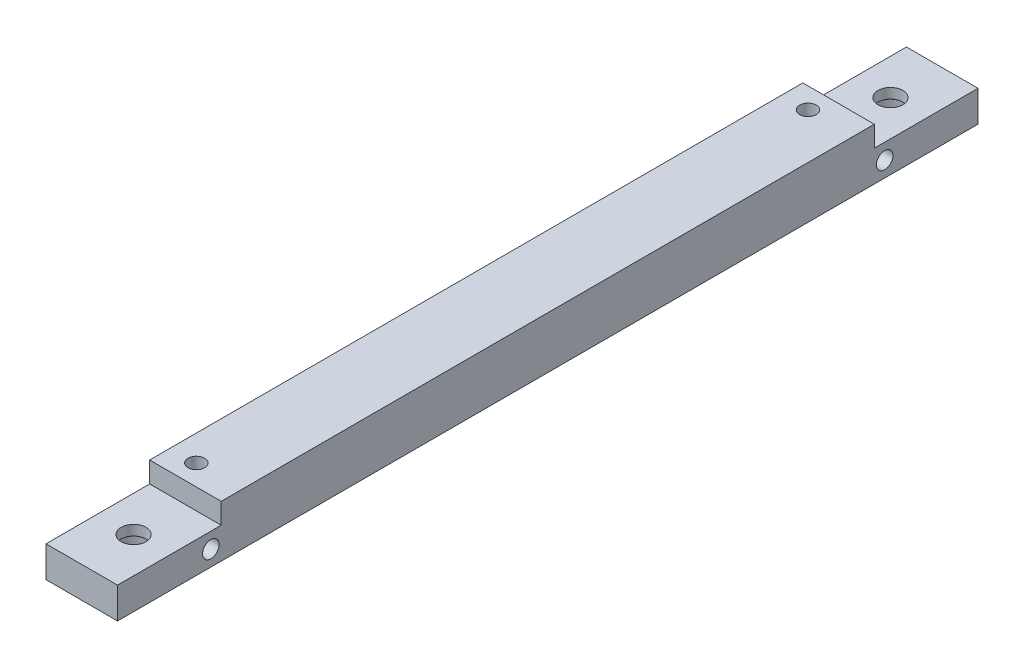
ISO-10303-21;
HEADER;
FILE_DESCRIPTION(('STEP AP214'),'2;1');
FILE_NAME('part.step','',(''),(''),'','','');
FILE_SCHEMA(('AUTOMOTIVE_DESIGN { 1 0 10303 214 1 1 1 1 }'));
ENDSEC;
DATA;
#1=APPLICATION_CONTEXT('core data for automotive mechanical design processes');
#2=APPLICATION_PROTOCOL_DEFINITION('international standard','automotive_design',2000,#1);
#3=PRODUCT_CONTEXT('',#1,'mechanical');
#4=PRODUCT('Part','Part','',(#3));
#5=PRODUCT_RELATED_PRODUCT_CATEGORY('part','',(#4));
#6=PRODUCT_DEFINITION_FORMATION('','',#4);
#7=PRODUCT_DEFINITION_CONTEXT('part definition',#1,'design');
#8=PRODUCT_DEFINITION('design','',#6,#7);
#9=PRODUCT_DEFINITION_SHAPE('','',#8);
#10=(LENGTH_UNIT() NAMED_UNIT(*) SI_UNIT(.MILLI.,.METRE.));
#11=(NAMED_UNIT(*) PLANE_ANGLE_UNIT() SI_UNIT($,.RADIAN.));
#12=(NAMED_UNIT(*) SI_UNIT($,.STERADIAN.) SOLID_ANGLE_UNIT());
#13=UNCERTAINTY_MEASURE_WITH_UNIT(LENGTH_MEASURE(1.E-05),#10,'distance_accuracy_value','');
#14=(GEOMETRIC_REPRESENTATION_CONTEXT(3) GLOBAL_UNCERTAINTY_ASSIGNED_CONTEXT((#13)) GLOBAL_UNIT_ASSIGNED_CONTEXT((#10,
#11,#12)) REPRESENTATION_CONTEXT('',''));
#15=CARTESIAN_POINT('',(0.,0.,0.));
#16=DIRECTION('',(0.,0.,1.));
#17=DIRECTION('',(1.,0.,0.));
#18=AXIS2_PLACEMENT_3D('',#15,#16,#17);
#19=CARTESIAN_POINT('',(8.5,-2.09841950804301,0.));
#20=DIRECTION('',(0.,0.,-1.));
#21=DIRECTION('',(0.,1.,0.));
#22=AXIS2_PLACEMENT_3D('',#19,#20,#21);
#23=PLANE('',#22);
#24=DIRECTION('',(1.,0.,0.));
#25=VECTOR('',#24,1.);
#26=CARTESIAN_POINT('',(0.,-5.09841950804301,0.));
#27=LINE('',#26,#25);
#28=CARTESIAN_POINT('',(1.6,-5.09841950804301,0.));
#29=VERTEX_POINT('',#28);
#30=CARTESIAN_POINT('',(8.5,-5.09841950804301,0.));
#31=VERTEX_POINT('',#30);
#32=EDGE_CURVE('E181',#29,#31,#27,.T.);
#33=ORIENTED_EDGE('',*,*,#32,.F.);
#34=DIRECTION('',(0.,-1.,0.));
#35=VECTOR('',#34,1.);
#36=CARTESIAN_POINT('',(1.6,1.90158049195699,0.));
#37=LINE('',#36,#35);
#38=CARTESIAN_POINT('',(1.6,-8.09841950804301,0.));
#39=VERTEX_POINT('',#38);
#40=EDGE_CURVE('E113',#29,#39,#37,.T.);
#41=ORIENTED_EDGE('',*,*,#40,.T.);
#42=DIRECTION('',(-1.,0.,0.));
#43=VECTOR('',#42,1.);
#44=CARTESIAN_POINT('',(8.5,-8.09841950804301,0.));
#45=LINE('',#44,#43);
#46=CARTESIAN_POINT('',(8.5,-8.09841950804301,0.));
#47=VERTEX_POINT('',#46);
#48=EDGE_CURVE('E46',#47,#39,#45,.T.);
#49=ORIENTED_EDGE('',*,*,#48,.F.);
#50=DIRECTION('',(0.,-1.,0.));
#51=VECTOR('',#50,1.);
#52=CARTESIAN_POINT('',(8.5,-2.09841950804301,0.));
#53=LINE('',#52,#51);
#54=EDGE_CURVE('E192',#31,#47,#53,.T.);
#55=ORIENTED_EDGE('',*,*,#54,.F.);
#56=EDGE_LOOP('',(#33,#41,#49,#55));
#57=FACE_BOUND('',#56,.T.);
#58=ADVANCED_FACE('F38',(#57),#23,.F.);
#59=CARTESIAN_POINT('',(8.5,-8.09841950804301,0.));
#60=DIRECTION('',(0.,1.,0.));
#61=DIRECTION('',(0.,0.,1.));
#62=AXIS2_PLACEMENT_3D('',#59,#60,#61);
#63=PLANE('',#62);
#64=CARTESIAN_POINT('',(4.1,-8.09841950804302,-71.));
#65=DIRECTION('',(0.,-1.,0.));
#66=DIRECTION('',(0.,0.,-1.));
#67=AXIS2_PLACEMENT_3D('',#64,#65,#66);
#68=CIRCLE('',#67,0.799999999999988);
#69=CARTESIAN_POINT('',(4.1,-8.09841950804302,-71.8));
#70=VERTEX_POINT('',#69);
#71=EDGE_CURVE('E443',#70,#70,#68,.T.);
#72=ORIENTED_EDGE('',*,*,#71,.F.);
#73=EDGE_LOOP('',(#72));
#74=FACE_BOUND('',#73,.T.);
#75=CARTESIAN_POINT('',(4.1,-8.09841950804302,-12.));
#76=DIRECTION('',(0.,-1.,0.));
#77=DIRECTION('',(0.,0.,-1.));
#78=AXIS2_PLACEMENT_3D('',#75,#76,#77);
#79=CIRCLE('',#78,0.799999999999988);
#80=CARTESIAN_POINT('',(4.1,-8.09841950804302,-12.8));
#81=VERTEX_POINT('',#80);
#82=EDGE_CURVE('E445',#81,#81,#79,.T.);
#83=ORIENTED_EDGE('',*,*,#82,.F.);
#84=EDGE_LOOP('',(#83));
#85=FACE_BOUND('',#84,.T.);
#86=CARTESIAN_POINT('',(5.05,-8.09841950804301,-5.));
#87=DIRECTION('',(0.,-1.,0.));
#88=DIRECTION('',(0.,0.,-1.));
#89=AXIS2_PLACEMENT_3D('',#86,#87,#88);
#90=CIRCLE('',#89,2.2);
#91=CARTESIAN_POINT('',(5.05,-8.09841950804301,-7.2));
#92=VERTEX_POINT('',#91);
#93=EDGE_CURVE('E453',#92,#92,#90,.T.);
#94=ORIENTED_EDGE('',*,*,#93,.F.);
#95=EDGE_LOOP('',(#94));
#96=FACE_BOUND('',#95,.T.);
#97=CARTESIAN_POINT('',(5.05,-8.09841950804301,-78.));
#98=DIRECTION('',(0.,-1.,0.));
#99=DIRECTION('',(0.,0.,-1.));
#100=AXIS2_PLACEMENT_3D('',#97,#98,#99);
#101=CIRCLE('',#100,2.2);
#102=CARTESIAN_POINT('',(5.05,-8.09841950804301,-80.2));
#103=VERTEX_POINT('',#102);
#104=EDGE_CURVE('E465',#103,#103,#101,.T.);
#105=ORIENTED_EDGE('',*,*,#104,.F.);
#106=EDGE_LOOP('',(#105));
#107=FACE_BOUND('',#106,.T.);
#108=ORIENTED_EDGE('',*,*,#48,.T.);
#109=DIRECTION('',(0.,0.,1.));
#110=VECTOR('',#109,1.);
#111=CARTESIAN_POINT('',(1.6,-8.09841950804301,-83.));
#112=LINE('',#111,#110);
#113=CARTESIAN_POINT('',(1.6,-8.09841950804301,-83.));
#114=VERTEX_POINT('',#113);
#115=EDGE_CURVE('E106',#114,#39,#112,.T.);
#116=ORIENTED_EDGE('',*,*,#115,.F.);
#117=DIRECTION('',(-1.,0.,0.));
#118=VECTOR('',#117,1.);
#119=CARTESIAN_POINT('',(8.5,-8.09841950804301,-83.));
#120=LINE('',#119,#118);
#121=CARTESIAN_POINT('',(8.5,-8.09841950804301,-83.));
#122=VERTEX_POINT('',#121);
#123=EDGE_CURVE('E120',#122,#114,#120,.T.);
#124=ORIENTED_EDGE('',*,*,#123,.F.);
#125=DIRECTION('',(0.,0.,-1.));
#126=VECTOR('',#125,1.);
#127=CARTESIAN_POINT('',(8.5,-8.09841950804301,0.));
#128=LINE('',#127,#126);
#129=EDGE_CURVE('E130',#47,#122,#128,.T.);
#130=ORIENTED_EDGE('',*,*,#129,.F.);
#131=EDGE_LOOP('',(#108,#116,#124,#130));
#132=FACE_BOUND('',#131,.T.);
#133=ADVANCED_FACE('F118',(#74,#85,#96,#107,#132),#63,.F.);
#134=CARTESIAN_POINT('',(8.5,-2.09841950804301,-83.));
#135=DIRECTION('',(0.,0.,1.));
#136=DIRECTION('',(1.,0.,0.));
#137=AXIS2_PLACEMENT_3D('',#134,#135,#136);
#138=PLANE('',#137);
#139=ORIENTED_EDGE('',*,*,#123,.T.);
#140=DIRECTION('',(0.,-1.,0.));
#141=VECTOR('',#140,1.);
#142=CARTESIAN_POINT('',(1.6,1.90158049195699,-83.));
#143=LINE('',#142,#141);
#144=CARTESIAN_POINT('',(1.6,-5.09841950804301,-83.));
#145=VERTEX_POINT('',#144);
#146=EDGE_CURVE('E102',#145,#114,#143,.T.);
#147=ORIENTED_EDGE('',*,*,#146,.F.);
#148=DIRECTION('',(1.,0.,0.));
#149=VECTOR('',#148,1.);
#150=CARTESIAN_POINT('',(-1.5,-5.09841950804301,-83.));
#151=LINE('',#150,#149);
#152=CARTESIAN_POINT('',(8.5,-5.09841950804301,-83.));
#153=VERTEX_POINT('',#152);
#154=EDGE_CURVE('E179',#145,#153,#151,.T.);
#155=ORIENTED_EDGE('',*,*,#154,.T.);
#156=DIRECTION('',(0.,1.,0.));
#157=VECTOR('',#156,1.);
#158=CARTESIAN_POINT('',(8.5,-2.09841950804301,-83.));
#159=LINE('',#158,#157);
#160=EDGE_CURVE('E127',#122,#153,#159,.T.);
#161=ORIENTED_EDGE('',*,*,#160,.F.);
#162=EDGE_LOOP('',(#139,#147,#155,#161));
#163=FACE_BOUND('',#162,.T.);
#164=ADVANCED_FACE('F125',(#163),#138,.F.);
#165=CARTESIAN_POINT('',(8.5,0.,0.));
#166=DIRECTION('',(1.,0.,0.));
#167=DIRECTION('',(0.,0.,-1.));
#168=AXIS2_PLACEMENT_3D('',#165,#166,#167);
#169=PLANE('',#168);
#170=CARTESIAN_POINT('',(8.5,-6.59841950804301,-74.));
#171=DIRECTION('',(-1.,0.,0.));
#172=DIRECTION('',(0.,0.,1.));
#173=AXIS2_PLACEMENT_3D('',#170,#171,#172);
#174=CIRCLE('',#173,0.799999999999998);
#175=CARTESIAN_POINT('',(8.5,-6.59841950804301,-73.2));
#176=VERTEX_POINT('',#175);
#177=EDGE_CURVE('E162',#176,#176,#174,.T.);
#178=ORIENTED_EDGE('',*,*,#177,.T.);
#179=EDGE_LOOP('',(#178));
#180=FACE_BOUND('',#179,.T.);
#181=CARTESIAN_POINT('',(8.5,-6.59841950804301,-9.));
#182=DIRECTION('',(-1.,0.,0.));
#183=DIRECTION('',(0.,0.,1.));
#184=AXIS2_PLACEMENT_3D('',#181,#182,#183);
#185=CIRCLE('',#184,0.799999999999998);
#186=CARTESIAN_POINT('',(8.5,-6.59841950804301,-8.2));
#187=VERTEX_POINT('',#186);
#188=EDGE_CURVE('E165',#187,#187,#185,.T.);
#189=ORIENTED_EDGE('',*,*,#188,.T.);
#190=EDGE_LOOP('',(#189));
#191=FACE_BOUND('',#190,.T.);
#192=DIRECTION('',(0.,0.,-1.));
#193=VECTOR('',#192,1.);
#194=CARTESIAN_POINT('',(8.5,-3.09841950804302,0.));
#195=LINE('',#194,#193);
#196=CARTESIAN_POINT('',(8.5,-3.09841950804302,-10.));
#197=VERTEX_POINT('',#196);
#198=CARTESIAN_POINT('',(8.5,-3.09841950804302,-73.));
#199=VERTEX_POINT('',#198);
#200=EDGE_CURVE('E171',#197,#199,#195,.T.);
#201=ORIENTED_EDGE('',*,*,#200,.F.);
#202=DIRECTION('',(0.,1.,0.));
#203=VECTOR('',#202,1.);
#204=CARTESIAN_POINT('',(8.5,-5.09841950804301,-10.));
#205=LINE('',#204,#203);
#206=CARTESIAN_POINT('',(8.5,-5.09841950804301,-10.));
#207=VERTEX_POINT('',#206);
#208=EDGE_CURVE('E189',#207,#197,#205,.T.);
#209=ORIENTED_EDGE('',*,*,#208,.F.);
#210=DIRECTION('',(0.,0.,-1.));
#211=VECTOR('',#210,1.);
#212=CARTESIAN_POINT('',(8.5,-5.09841950804301,-10.));
#213=LINE('',#212,#211);
#214=EDGE_CURVE('E184',#31,#207,#213,.T.);
#215=ORIENTED_EDGE('',*,*,#214,.F.);
#216=ORIENTED_EDGE('',*,*,#54,.T.);
#217=ORIENTED_EDGE('',*,*,#129,.T.);
#218=ORIENTED_EDGE('',*,*,#160,.T.);
#219=DIRECTION('',(0.,0.,-1.));
#220=VECTOR('',#219,1.);
#221=CARTESIAN_POINT('',(8.5,-5.09841950804301,-83.));
#222=LINE('',#221,#220);
#223=CARTESIAN_POINT('',(8.5,-5.09841950804301,-73.));
#224=VERTEX_POINT('',#223);
#225=EDGE_CURVE('E175',#224,#153,#222,.T.);
#226=ORIENTED_EDGE('',*,*,#225,.F.);
#227=DIRECTION('',(0.,-1.,0.));
#228=VECTOR('',#227,1.);
#229=CARTESIAN_POINT('',(8.5,-2.09841950804302,-73.));
#230=LINE('',#229,#228);
#231=EDGE_CURVE('E173',#199,#224,#230,.T.);
#232=ORIENTED_EDGE('',*,*,#231,.F.);
#233=EDGE_LOOP('',(#201,#209,#215,#216,#217,#218,#226,#232));
#234=FACE_BOUND('',#233,.T.);
#235=ADVANCED_FACE('F195',(#180,#191,#234),#169,.T.);
#236=CARTESIAN_POINT('',(0.,-5.09841950804301,-10.));
#237=DIRECTION('',(0.,0.,-1.));
#238=DIRECTION('',(-1.,0.,0.));
#239=AXIS2_PLACEMENT_3D('',#236,#237,#238);
#240=PLANE('',#239);
#241=DIRECTION('',(-1.,0.,0.));
#242=VECTOR('',#241,1.);
#243=CARTESIAN_POINT('',(10.,-3.09841950804302,-10.));
#244=LINE('',#243,#242);
#245=CARTESIAN_POINT('',(1.6,-3.09841950804302,-10.));
#246=VERTEX_POINT('',#245);
#247=EDGE_CURVE('E168',#197,#246,#244,.T.);
#248=ORIENTED_EDGE('',*,*,#247,.T.);
#249=DIRECTION('',(0.,-1.,0.));
#250=VECTOR('',#249,1.);
#251=CARTESIAN_POINT('',(1.6,-5.09841950804301,-10.));
#252=LINE('',#251,#250);
#253=CARTESIAN_POINT('',(1.6,-5.09841950804301,-10.));
#254=VERTEX_POINT('',#253);
#255=EDGE_CURVE('E54',#246,#254,#252,.T.);
#256=ORIENTED_EDGE('',*,*,#255,.T.);
#257=DIRECTION('',(-1.,0.,0.));
#258=VECTOR('',#257,1.);
#259=CARTESIAN_POINT('',(0.,-5.09841950804301,-10.));
#260=LINE('',#259,#258);
#261=EDGE_CURVE('E186',#207,#254,#260,.T.);
#262=ORIENTED_EDGE('',*,*,#261,.F.);
#263=ORIENTED_EDGE('',*,*,#208,.T.);
#264=EDGE_LOOP('',(#248,#256,#262,#263));
#265=FACE_BOUND('',#264,.T.);
#266=ADVANCED_FACE('F207',(#265),#240,.F.);
#267=CARTESIAN_POINT('',(0.,-5.09841950804301,0.));
#268=DIRECTION('',(0.,1.,0.));
#269=DIRECTION('',(0.,0.,1.));
#270=AXIS2_PLACEMENT_3D('',#267,#268,#269);
#271=PLANE('',#270);
#272=CARTESIAN_POINT('',(5.05,-5.09841950804301,-5.));
#273=DIRECTION('',(0.,1.,0.));
#274=DIRECTION('',(0.,0.,1.));
#275=AXIS2_PLACEMENT_3D('',#272,#273,#274);
#276=CIRCLE('',#275,1.2);
#277=CARTESIAN_POINT('',(5.05,-5.09841950804301,-3.8));
#278=VERTEX_POINT('',#277);
#279=EDGE_CURVE('E41',#278,#278,#276,.T.);
#280=ORIENTED_EDGE('',*,*,#279,.F.);
#281=EDGE_LOOP('',(#280));
#282=FACE_BOUND('',#281,.T.);
#283=DIRECTION('',(0.,0.,-1.));
#284=VECTOR('',#283,1.);
#285=CARTESIAN_POINT('',(1.6,-5.09841950804301,0.));
#286=LINE('',#285,#284);
#287=EDGE_CURVE('E160',#29,#254,#286,.T.);
#288=ORIENTED_EDGE('',*,*,#287,.F.);
#289=ORIENTED_EDGE('',*,*,#32,.T.);
#290=ORIENTED_EDGE('',*,*,#214,.T.);
#291=ORIENTED_EDGE('',*,*,#261,.T.);
#292=EDGE_LOOP('',(#288,#289,#290,#291));
#293=FACE_BOUND('',#292,.T.);
#294=ADVANCED_FACE('F203',(#282,#293),#271,.T.);
#295=CARTESIAN_POINT('',(-1.5,-5.09841950804301,-83.));
#296=DIRECTION('',(0.,-1.,0.));
#297=DIRECTION('',(0.,0.,-1.));
#298=AXIS2_PLACEMENT_3D('',#295,#296,#297);
#299=PLANE('',#298);
#300=CARTESIAN_POINT('',(5.05,-5.09841950804301,-78.));
#301=DIRECTION('',(0.,-1.,0.));
#302=DIRECTION('',(0.,0.,-1.));
#303=AXIS2_PLACEMENT_3D('',#300,#301,#302);
#304=CIRCLE('',#303,1.2);
#305=CARTESIAN_POINT('',(5.05,-5.09841950804301,-79.2));
#306=VERTEX_POINT('',#305);
#307=EDGE_CURVE('E123',#306,#306,#304,.T.);
#308=ORIENTED_EDGE('',*,*,#307,.T.);
#309=EDGE_LOOP('',(#308));
#310=FACE_BOUND('',#309,.T.);
#311=ORIENTED_EDGE('',*,*,#154,.F.);
#312=DIRECTION('',(0.,0.,1.));
#313=VECTOR('',#312,1.);
#314=CARTESIAN_POINT('',(1.6,-5.09841950804301,-83.));
#315=LINE('',#314,#313);
#316=CARTESIAN_POINT('',(1.6,-5.09841950804301,-73.));
#317=VERTEX_POINT('',#316);
#318=EDGE_CURVE('E109',#145,#317,#315,.T.);
#319=ORIENTED_EDGE('',*,*,#318,.T.);
#320=DIRECTION('',(1.,0.,0.));
#321=VECTOR('',#320,1.);
#322=CARTESIAN_POINT('',(-1.5,-5.09841950804301,-73.));
#323=LINE('',#322,#321);
#324=EDGE_CURVE('E178',#317,#224,#323,.T.);
#325=ORIENTED_EDGE('',*,*,#324,.T.);
#326=ORIENTED_EDGE('',*,*,#225,.T.);
#327=EDGE_LOOP('',(#311,#319,#325,#326));
#328=FACE_BOUND('',#327,.T.);
#329=ADVANCED_FACE('F214',(#310,#328),#299,.F.);
#330=CARTESIAN_POINT('',(-1.5,-2.09841950804302,-73.));
#331=DIRECTION('',(0.,0.,1.));
#332=DIRECTION('',(1.,0.,0.));
#333=AXIS2_PLACEMENT_3D('',#330,#331,#332);
#334=PLANE('',#333);
#335=ORIENTED_EDGE('',*,*,#324,.F.);
#336=DIRECTION('',(0.,1.,0.));
#337=VECTOR('',#336,1.);
#338=CARTESIAN_POINT('',(1.6,-2.09841950804302,-73.));
#339=LINE('',#338,#337);
#340=CARTESIAN_POINT('',(1.6,-3.09841950804302,-73.));
#341=VERTEX_POINT('',#340);
#342=EDGE_CURVE('E156',#317,#341,#339,.T.);
#343=ORIENTED_EDGE('',*,*,#342,.T.);
#344=DIRECTION('',(1.,0.,0.));
#345=VECTOR('',#344,1.);
#346=CARTESIAN_POINT('',(-1.5,-3.09841950804302,-73.));
#347=LINE('',#346,#345);
#348=EDGE_CURVE('E11',#341,#199,#347,.T.);
#349=ORIENTED_EDGE('',*,*,#348,.T.);
#350=ORIENTED_EDGE('',*,*,#231,.T.);
#351=EDGE_LOOP('',(#335,#343,#349,#350));
#352=FACE_BOUND('',#351,.T.);
#353=ADVANCED_FACE('F212',(#352),#334,.F.);
#354=CARTESIAN_POINT('',(10.,-3.09841950804302,-73.));
#355=DIRECTION('',(0.,-1.,0.));
#356=DIRECTION('',(0.,0.,-1.));
#357=AXIS2_PLACEMENT_3D('',#354,#355,#356);
#358=PLANE('',#357);
#359=CARTESIAN_POINT('',(4.1,-3.09841950804302,-71.));
#360=DIRECTION('',(0.,-1.,0.));
#361=DIRECTION('',(0.,0.,-1.));
#362=AXIS2_PLACEMENT_3D('',#359,#360,#361);
#363=CIRCLE('',#362,0.799999999999999);
#364=CARTESIAN_POINT('',(4.1,-3.09841950804302,-71.8));
#365=VERTEX_POINT('',#364);
#366=EDGE_CURVE('E441',#365,#365,#363,.T.);
#367=ORIENTED_EDGE('',*,*,#366,.T.);
#368=EDGE_LOOP('',(#367));
#369=FACE_BOUND('',#368,.T.);
#370=CARTESIAN_POINT('',(4.1,-3.09841950804302,-12.));
#371=DIRECTION('',(0.,-1.,0.));
#372=DIRECTION('',(0.,0.,-1.));
#373=AXIS2_PLACEMENT_3D('',#370,#371,#372);
#374=CIRCLE('',#373,0.799999999999999);
#375=CARTESIAN_POINT('',(4.1,-3.09841950804302,-12.8));
#376=VERTEX_POINT('',#375);
#377=EDGE_CURVE('E450',#376,#376,#374,.T.);
#378=ORIENTED_EDGE('',*,*,#377,.T.);
#379=EDGE_LOOP('',(#378));
#380=FACE_BOUND('',#379,.T.);
#381=ORIENTED_EDGE('',*,*,#348,.F.);
#382=DIRECTION('',(0.,0.,1.));
#383=VECTOR('',#382,1.);
#384=CARTESIAN_POINT('',(1.6,-3.09841950804302,-73.));
#385=LINE('',#384,#383);
#386=EDGE_CURVE('E154',#341,#246,#385,.T.);
#387=ORIENTED_EDGE('',*,*,#386,.T.);
#388=ORIENTED_EDGE('',*,*,#247,.F.);
#389=ORIENTED_EDGE('',*,*,#200,.T.);
#390=EDGE_LOOP('',(#381,#387,#388,#389));
#391=FACE_BOUND('',#390,.T.);
#392=ADVANCED_FACE('F210',(#369,#380,#391),#358,.F.);
#393=CARTESIAN_POINT('',(0.,-6.59841950804301,-9.));
#394=DIRECTION('',(-1.,0.,0.));
#395=DIRECTION('',(0.,0.,1.));
#396=AXIS2_PLACEMENT_3D('',#393,#394,#395);
#397=CYLINDRICAL_SURFACE('',#396,0.799999999999998);
#398=CARTESIAN_POINT('',(1.6,-6.59841950804301,-9.));
#399=DIRECTION('',(1.,0.,0.));
#400=DIRECTION('',(0.,0.,-1.));
#401=AXIS2_PLACEMENT_3D('',#398,#399,#400);
#402=CIRCLE('',#401,0.799999999999998);
#403=CARTESIAN_POINT('',(1.6,-6.59841950804301,-9.8));
#404=VERTEX_POINT('',#403);
#405=EDGE_CURVE('E136',#404,#404,#402,.F.);
#406=ORIENTED_EDGE('',*,*,#405,.T.);
#407=EDGE_LOOP('',(#406));
#408=FACE_BOUND('',#407,.T.);
#409=ORIENTED_EDGE('',*,*,#188,.F.);
#410=EDGE_LOOP('',(#409));
#411=FACE_BOUND('',#410,.T.);
#412=ADVANCED_FACE('F361',(#408,#411),#397,.F.);
#413=CARTESIAN_POINT('',(0.,-6.59841950804301,-74.));
#414=DIRECTION('',(-1.,0.,0.));
#415=DIRECTION('',(0.,0.,1.));
#416=AXIS2_PLACEMENT_3D('',#413,#414,#415);
#417=CYLINDRICAL_SURFACE('',#416,0.799999999999998);
#418=CARTESIAN_POINT('',(1.6,-6.59841950804301,-74.));
#419=DIRECTION('',(1.,0.,0.));
#420=DIRECTION('',(0.,0.,-1.));
#421=AXIS2_PLACEMENT_3D('',#418,#419,#420);
#422=CIRCLE('',#421,0.799999999999998);
#423=CARTESIAN_POINT('',(1.6,-6.59841950804301,-74.8));
#424=VERTEX_POINT('',#423);
#425=EDGE_CURVE('E134',#424,#424,#422,.F.);
#426=ORIENTED_EDGE('',*,*,#425,.T.);
#427=EDGE_LOOP('',(#426));
#428=FACE_BOUND('',#427,.T.);
#429=ORIENTED_EDGE('',*,*,#177,.F.);
#430=EDGE_LOOP('',(#429));
#431=FACE_BOUND('',#430,.T.);
#432=ADVANCED_FACE('F392',(#428,#431),#417,.F.);
#433=CARTESIAN_POINT('',(1.6,1.90158049195699,-83.));
#434=DIRECTION('',(1.,0.,0.));
#435=DIRECTION('',(0.,0.,-1.));
#436=AXIS2_PLACEMENT_3D('',#433,#434,#435);
#437=PLANE('',#436);
#438=ORIENTED_EDGE('',*,*,#287,.T.);
#439=ORIENTED_EDGE('',*,*,#255,.F.);
#440=ORIENTED_EDGE('',*,*,#386,.F.);
#441=ORIENTED_EDGE('',*,*,#342,.F.);
#442=ORIENTED_EDGE('',*,*,#318,.F.);
#443=ORIENTED_EDGE('',*,*,#146,.T.);
#444=ORIENTED_EDGE('',*,*,#115,.T.);
#445=ORIENTED_EDGE('',*,*,#40,.F.);
#446=EDGE_LOOP('',(#438,#439,#440,#441,#442,#443,#444,#445));
#447=FACE_BOUND('',#446,.T.);
#448=ORIENTED_EDGE('',*,*,#425,.F.);
#449=EDGE_LOOP('',(#448));
#450=FACE_BOUND('',#449,.T.);
#451=ORIENTED_EDGE('',*,*,#405,.F.);
#452=EDGE_LOOP('',(#451));
#453=FACE_BOUND('',#452,.T.);
#454=ADVANCED_FACE('F104',(#447,#450,#453),#437,.F.);
#455=CARTESIAN_POINT('',(5.05,-8.09841950804301,-78.));
#456=DIRECTION('',(0.,-1.,0.));
#457=DIRECTION('',(0.,0.,-1.));
#458=AXIS2_PLACEMENT_3D('',#455,#456,#457);
#459=CYLINDRICAL_SURFACE('',#458,1.2);
#460=CARTESIAN_POINT('',(5.05,-6.07341950804301,-78.));
#461=DIRECTION('',(0.,-1.,0.));
#462=DIRECTION('',(0.,0.,-1.));
#463=AXIS2_PLACEMENT_3D('',#460,#461,#462);
#464=CIRCLE('',#463,1.2);
#465=CARTESIAN_POINT('',(5.05,-6.07341950804301,-79.2));
#466=VERTEX_POINT('',#465);
#467=EDGE_CURVE('E138',#466,#466,#464,.T.);
#468=ORIENTED_EDGE('',*,*,#467,.T.);
#469=EDGE_LOOP('',(#468));
#470=FACE_BOUND('',#469,.T.);
#471=ORIENTED_EDGE('',*,*,#307,.F.);
#472=EDGE_LOOP('',(#471));
#473=FACE_BOUND('',#472,.T.);
#474=ADVANCED_FACE('F266',(#470,#473),#459,.F.);
#475=CARTESIAN_POINT('',(5.05,-6.09841950804301,-78.));
#476=DIRECTION('',(0.,-1.,0.));
#477=DIRECTION('',(0.,0.,-1.));
#478=AXIS2_PLACEMENT_3D('',#475,#476,#477);
#479=CONICAL_SURFACE('',#478,1.225,0.785398163397466);
#480=ORIENTED_EDGE('',*,*,#467,.F.);
#481=EDGE_LOOP('',(#480));
#482=FACE_BOUND('',#481,.T.);
#483=CARTESIAN_POINT('',(5.05,-6.09841950804301,-78.));
#484=DIRECTION('',(0.,-1.,0.));
#485=DIRECTION('',(0.,0.,-1.));
#486=AXIS2_PLACEMENT_3D('',#483,#484,#485);
#487=CIRCLE('',#486,1.225);
#488=CARTESIAN_POINT('',(5.05,-6.09841950804301,-79.225));
#489=VERTEX_POINT('',#488);
#490=EDGE_CURVE('E142',#489,#489,#487,.T.);
#491=ORIENTED_EDGE('',*,*,#490,.T.);
#492=EDGE_LOOP('',(#491));
#493=FACE_BOUND('',#492,.T.);
#494=ADVANCED_FACE('F271',(#482,#493),#479,.F.);
#495=CARTESIAN_POINT('',(6.275,-6.09841950804301,-78.));
#496=DIRECTION('',(0.,1.,0.));
#497=DIRECTION('',(0.,0.,1.));
#498=AXIS2_PLACEMENT_3D('',#495,#496,#497);
#499=PLANE('',#498);
#500=ORIENTED_EDGE('',*,*,#490,.F.);
#501=EDGE_LOOP('',(#500));
#502=FACE_BOUND('',#501,.T.);
#503=CARTESIAN_POINT('',(5.05,-6.09841950804301,-78.));
#504=DIRECTION('',(0.,-1.,0.));
#505=DIRECTION('',(0.,0.,-1.));
#506=AXIS2_PLACEMENT_3D('',#503,#504,#505);
#507=CIRCLE('',#506,2.2);
#508=CARTESIAN_POINT('',(5.05,-6.09841950804301,-80.2));
#509=VERTEX_POINT('',#508);
#510=EDGE_CURVE('E147',#509,#509,#507,.T.);
#511=ORIENTED_EDGE('',*,*,#510,.T.);
#512=EDGE_LOOP('',(#511));
#513=FACE_BOUND('',#512,.T.);
#514=ADVANCED_FACE('F281',(#502,#513),#499,.F.);
#515=CARTESIAN_POINT('',(5.05,-8.09841950804301,-78.));
#516=DIRECTION('',(0.,-1.,0.));
#517=DIRECTION('',(0.,0.,-1.));
#518=AXIS2_PLACEMENT_3D('',#515,#516,#517);
#519=CYLINDRICAL_SURFACE('',#518,2.2);
#520=ORIENTED_EDGE('',*,*,#510,.F.);
#521=EDGE_LOOP('',(#520));
#522=FACE_BOUND('',#521,.T.);
#523=ORIENTED_EDGE('',*,*,#104,.T.);
#524=EDGE_LOOP('',(#523));
#525=FACE_BOUND('',#524,.T.);
#526=ADVANCED_FACE('F291',(#522,#525),#519,.F.);
#527=CARTESIAN_POINT('',(5.05,-8.09841950804301,-5.));
#528=DIRECTION('',(0.,-1.,0.));
#529=DIRECTION('',(0.,0.,-1.));
#530=AXIS2_PLACEMENT_3D('',#527,#528,#529);
#531=CYLINDRICAL_SURFACE('',#530,1.2);
#532=ORIENTED_EDGE('',*,*,#279,.T.);
#533=EDGE_LOOP('',(#532));
#534=FACE_BOUND('',#533,.T.);
#535=CARTESIAN_POINT('',(5.05,-6.07341950804301,-5.));
#536=DIRECTION('',(0.,-1.,0.));
#537=DIRECTION('',(0.,0.,-1.));
#538=AXIS2_PLACEMENT_3D('',#535,#536,#537);
#539=CIRCLE('',#538,1.2);
#540=CARTESIAN_POINT('',(5.05,-6.07341950804301,-6.2));
#541=VERTEX_POINT('',#540);
#542=EDGE_CURVE('E462',#541,#541,#539,.T.);
#543=ORIENTED_EDGE('',*,*,#542,.T.);
#544=EDGE_LOOP('',(#543));
#545=FACE_BOUND('',#544,.T.);
#546=ADVANCED_FACE('F301',(#534,#545),#531,.F.);
#547=CARTESIAN_POINT('',(5.05,-6.09841950804301,-5.));
#548=DIRECTION('',(0.,-1.,0.));
#549=DIRECTION('',(0.,0.,-1.));
#550=AXIS2_PLACEMENT_3D('',#547,#548,#549);
#551=CONICAL_SURFACE('',#550,1.225,0.785398163397466);
#552=ORIENTED_EDGE('',*,*,#542,.F.);
#553=EDGE_LOOP('',(#552));
#554=FACE_BOUND('',#553,.T.);
#555=CARTESIAN_POINT('',(5.05,-6.09841950804301,-5.));
#556=DIRECTION('',(0.,-1.,0.));
#557=DIRECTION('',(0.,0.,-1.));
#558=AXIS2_PLACEMENT_3D('',#555,#556,#557);
#559=CIRCLE('',#558,1.225);
#560=CARTESIAN_POINT('',(5.05,-6.09841950804301,-6.225));
#561=VERTEX_POINT('',#560);
#562=EDGE_CURVE('E459',#561,#561,#559,.T.);
#563=ORIENTED_EDGE('',*,*,#562,.T.);
#564=EDGE_LOOP('',(#563));
#565=FACE_BOUND('',#564,.T.);
#566=ADVANCED_FACE('F311',(#554,#565),#551,.F.);
#567=CARTESIAN_POINT('',(6.275,-6.09841950804301,-5.));
#568=DIRECTION('',(0.,1.,0.));
#569=DIRECTION('',(0.,0.,1.));
#570=AXIS2_PLACEMENT_3D('',#567,#568,#569);
#571=PLANE('',#570);
#572=ORIENTED_EDGE('',*,*,#562,.F.);
#573=EDGE_LOOP('',(#572));
#574=FACE_BOUND('',#573,.T.);
#575=CARTESIAN_POINT('',(5.05,-6.09841950804301,-5.));
#576=DIRECTION('',(0.,-1.,0.));
#577=DIRECTION('',(0.,0.,-1.));
#578=AXIS2_PLACEMENT_3D('',#575,#576,#577);
#579=CIRCLE('',#578,2.2);
#580=CARTESIAN_POINT('',(5.05,-6.09841950804301,-7.2));
#581=VERTEX_POINT('',#580);
#582=EDGE_CURVE('E456',#581,#581,#579,.T.);
#583=ORIENTED_EDGE('',*,*,#582,.T.);
#584=EDGE_LOOP('',(#583));
#585=FACE_BOUND('',#584,.T.);
#586=ADVANCED_FACE('F321',(#574,#585),#571,.F.);
#587=CARTESIAN_POINT('',(5.05,-8.09841950804301,-5.));
#588=DIRECTION('',(0.,-1.,0.));
#589=DIRECTION('',(0.,0.,-1.));
#590=AXIS2_PLACEMENT_3D('',#587,#588,#589);
#591=CYLINDRICAL_SURFACE('',#590,2.2);
#592=ORIENTED_EDGE('',*,*,#582,.F.);
#593=EDGE_LOOP('',(#592));
#594=FACE_BOUND('',#593,.T.);
#595=ORIENTED_EDGE('',*,*,#93,.T.);
#596=EDGE_LOOP('',(#595));
#597=FACE_BOUND('',#596,.T.);
#598=ADVANCED_FACE('F331',(#594,#597),#591,.F.);
#599=CARTESIAN_POINT('',(4.1,-8.09841950804301,-12.));
#600=DIRECTION('',(0.,-1.,0.));
#601=DIRECTION('',(0.,0.,-1.));
#602=AXIS2_PLACEMENT_3D('',#599,#600,#601);
#603=CYLINDRICAL_SURFACE('',#602,0.799999999999993);
#604=ORIENTED_EDGE('',*,*,#377,.F.);
#605=EDGE_LOOP('',(#604));
#606=FACE_BOUND('',#605,.T.);
#607=ORIENTED_EDGE('',*,*,#82,.T.);
#608=EDGE_LOOP('',(#607));
#609=FACE_BOUND('',#608,.T.);
#610=ADVANCED_FACE('F341',(#606,#609),#603,.F.);
#611=CARTESIAN_POINT('',(4.1,-8.09841950804301,-71.));
#612=DIRECTION('',(0.,-1.,0.));
#613=DIRECTION('',(0.,0.,-1.));
#614=AXIS2_PLACEMENT_3D('',#611,#612,#613);
#615=CYLINDRICAL_SURFACE('',#614,0.799999999999993);
#616=ORIENTED_EDGE('',*,*,#366,.F.);
#617=EDGE_LOOP('',(#616));
#618=FACE_BOUND('',#617,.T.);
#619=ORIENTED_EDGE('',*,*,#71,.T.);
#620=EDGE_LOOP('',(#619));
#621=FACE_BOUND('',#620,.T.);
#622=ADVANCED_FACE('F371',(#618,#621),#615,.F.);
#623=CLOSED_SHELL('',(#58,#133,#164,#235,#266,#294,#329,#353,#392,#412,#432,#454,#474,#494,#514,
#526,#546,#566,#586,#598,#610,#622));
#624=MANIFOLD_SOLID_BREP('B2',#623);
#625=ADVANCED_BREP_SHAPE_REPRESENTATION('',(#18,#624),#14);
#626=SHAPE_DEFINITION_REPRESENTATION(#9,#625);
ENDSEC;
END-ISO-10303-21;
